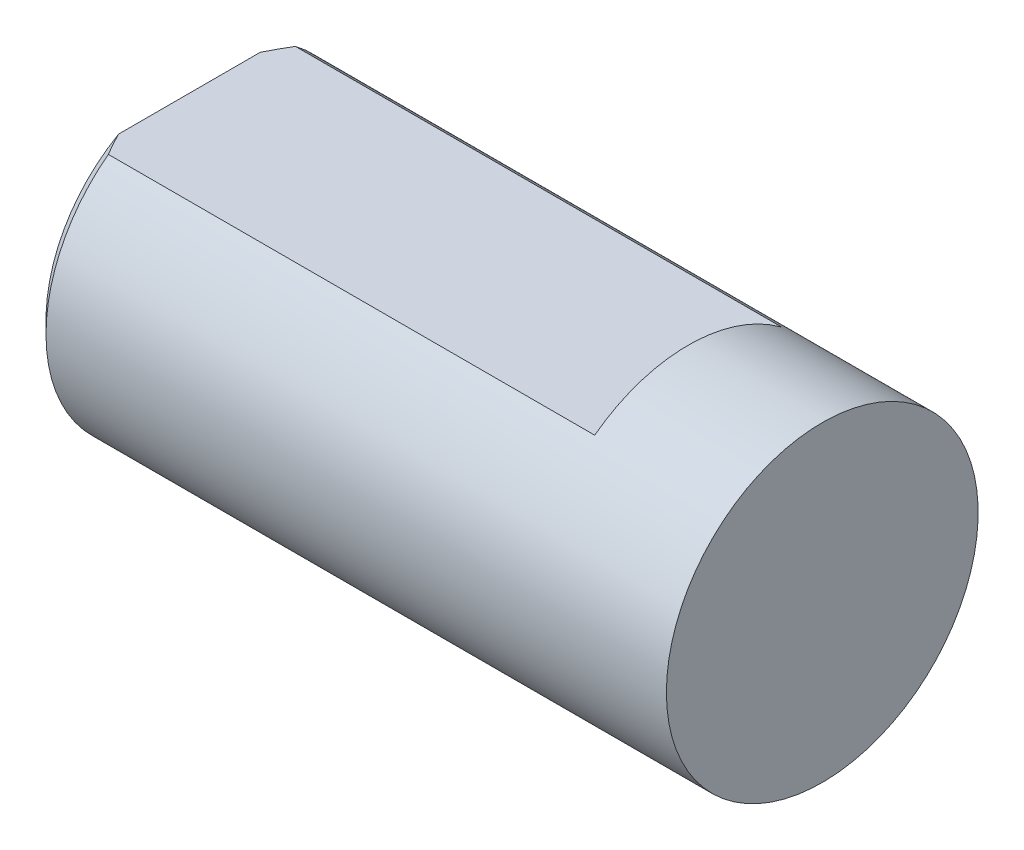
ISO-10303-21;
HEADER;
FILE_DESCRIPTION(('STEP AP214'),'2;1');
FILE_NAME('part.step','',(''),(''),'','','');
FILE_SCHEMA(('AUTOMOTIVE_DESIGN { 1 0 10303 214 1 1 1 1 }'));
ENDSEC;
DATA;
#1=APPLICATION_CONTEXT('core data for automotive mechanical design processes');
#2=APPLICATION_PROTOCOL_DEFINITION('international standard','automotive_design',2000,#1);
#3=PRODUCT_CONTEXT('',#1,'mechanical');
#4=PRODUCT('Part','Part','',(#3));
#5=PRODUCT_RELATED_PRODUCT_CATEGORY('part','',(#4));
#6=PRODUCT_DEFINITION_FORMATION('','',#4);
#7=PRODUCT_DEFINITION_CONTEXT('part definition',#1,'design');
#8=PRODUCT_DEFINITION('design','',#6,#7);
#9=PRODUCT_DEFINITION_SHAPE('','',#8);
#10=(LENGTH_UNIT() NAMED_UNIT(*) SI_UNIT(.MILLI.,.METRE.));
#11=(NAMED_UNIT(*) PLANE_ANGLE_UNIT() SI_UNIT($,.RADIAN.));
#12=(NAMED_UNIT(*) SI_UNIT($,.STERADIAN.) SOLID_ANGLE_UNIT());
#13=UNCERTAINTY_MEASURE_WITH_UNIT(LENGTH_MEASURE(1.E-05),#10,'distance_accuracy_value','');
#14=(GEOMETRIC_REPRESENTATION_CONTEXT(3) GLOBAL_UNCERTAINTY_ASSIGNED_CONTEXT((#13)) GLOBAL_UNIT_ASSIGNED_CONTEXT((#10,
#11,#12)) REPRESENTATION_CONTEXT('',''));
#15=CARTESIAN_POINT('',(0.,0.,0.));
#16=DIRECTION('',(0.,0.,1.));
#17=DIRECTION('',(1.,0.,0.));
#18=AXIS2_PLACEMENT_3D('',#15,#16,#17);
#19=CARTESIAN_POINT('',(0.,0.,0.));
#20=DIRECTION('',(-1.,0.,0.));
#21=DIRECTION('',(0.,0.,1.));
#22=AXIS2_PLACEMENT_3D('',#19,#20,#21);
#23=PLANE('',#22);
#24=CARTESIAN_POINT('',(0.,0.,0.));
#25=DIRECTION('',(-1.,0.,0.));
#26=DIRECTION('',(0.,0.,1.));
#27=AXIS2_PLACEMENT_3D('',#24,#25,#26);
#28=CIRCLE('',#27,2.5);
#29=CARTESIAN_POINT('',(0.,0.,2.5));
#30=VERTEX_POINT('',#29);
#31=EDGE_CURVE('E78',#30,#30,#28,.T.);
#32=ORIENTED_EDGE('',*,*,#31,.F.);
#33=EDGE_LOOP('',(#32));
#34=FACE_BOUND('',#33,.T.);
#35=ADVANCED_FACE('F32',(#34),#23,.F.);
#36=CARTESIAN_POINT('',(0.,0.,0.));
#37=DIRECTION('',(-1.,0.,0.));
#38=DIRECTION('',(0.,0.,1.));
#39=AXIS2_PLACEMENT_3D('',#36,#37,#38);
#40=CYLINDRICAL_SURFACE('',#39,2.5);
#41=DIRECTION('',(-1.,0.,0.));
#42=VECTOR('',#41,1.);
#43=CARTESIAN_POINT('',(-2.15,2.,1.5));
#44=LINE('',#43,#42);
#45=CARTESIAN_POINT('',(-2.15,2.,1.5));
#46=VERTEX_POINT('',#45);
#47=CARTESIAN_POINT('',(-9.95,2.,1.5));
#48=VERTEX_POINT('',#47);
#49=EDGE_CURVE('E67',#46,#48,#44,.T.);
#50=ORIENTED_EDGE('',*,*,#49,.T.);
#51=CARTESIAN_POINT('',(-9.95,0.,0.));
#52=DIRECTION('',(1.,0.,0.));
#53=DIRECTION('',(0.,0.,-1.));
#54=AXIS2_PLACEMENT_3D('',#51,#52,#53);
#55=CIRCLE('',#54,2.5);
#56=CARTESIAN_POINT('',(-9.95,2.,-1.5));
#57=VERTEX_POINT('',#56);
#58=EDGE_CURVE('E11',#48,#57,#55,.T.);
#59=ORIENTED_EDGE('',*,*,#58,.T.);
#60=DIRECTION('',(-1.,0.,0.));
#61=VECTOR('',#60,1.);
#62=CARTESIAN_POINT('',(-2.15,2.,-1.5));
#63=LINE('',#62,#61);
#64=CARTESIAN_POINT('',(-2.15,2.,-1.5));
#65=VERTEX_POINT('',#64);
#66=EDGE_CURVE('E65',#65,#57,#63,.T.);
#67=ORIENTED_EDGE('',*,*,#66,.F.);
#68=CARTESIAN_POINT('',(-2.15,0.,0.));
#69=DIRECTION('',(-1.,0.,0.));
#70=DIRECTION('',(0.,0.,1.));
#71=AXIS2_PLACEMENT_3D('',#68,#69,#70);
#72=CIRCLE('',#71,2.5);
#73=EDGE_CURVE('E70',#46,#65,#72,.T.);
#74=ORIENTED_EDGE('',*,*,#73,.F.);
#75=EDGE_LOOP('',(#50,#59,#67,#74));
#76=FACE_BOUND('',#75,.T.);
#77=ORIENTED_EDGE('',*,*,#31,.T.);
#78=EDGE_LOOP('',(#77));
#79=FACE_BOUND('',#78,.T.);
#80=ADVANCED_FACE('F75',(#76,#79),#40,.T.);
#81=CARTESIAN_POINT('',(-10.15,2.5,0.));
#82=DIRECTION('',(1.,0.,0.));
#83=DIRECTION('',(0.,0.,-1.));
#84=AXIS2_PLACEMENT_3D('',#81,#82,#83);
#85=PLANE('',#84);
#86=DIRECTION('',(0.,0.,1.));
#87=VECTOR('',#86,1.);
#88=CARTESIAN_POINT('',(-10.15,2.,0.));
#89=LINE('',#88,#87);
#90=CARTESIAN_POINT('',(-10.15,2.,-1.13578166916006));
#91=VERTEX_POINT('',#90);
#92=CARTESIAN_POINT('',(-10.15,2.,1.13578166916006));
#93=VERTEX_POINT('',#92);
#94=EDGE_CURVE('E73',#91,#93,#89,.T.);
#95=ORIENTED_EDGE('',*,*,#94,.F.);
#96=CARTESIAN_POINT('',(-10.15,0.,0.));
#97=DIRECTION('',(1.,0.,0.));
#98=DIRECTION('',(0.,0.,-1.));
#99=AXIS2_PLACEMENT_3D('',#96,#97,#98);
#100=CIRCLE('',#99,2.3);
#101=EDGE_CURVE('E83',#91,#93,#100,.F.);
#102=ORIENTED_EDGE('',*,*,#101,.T.);
#103=EDGE_LOOP('',(#95,#102));
#104=FACE_BOUND('',#103,.T.);
#105=ADVANCED_FACE('F101',(#104),#85,.F.);
#106=CARTESIAN_POINT('',(-2.15,2.,0.));
#107=DIRECTION('',(0.,-1.,0.));
#108=DIRECTION('',(0.,0.,-1.));
#109=AXIS2_PLACEMENT_3D('',#106,#107,#108);
#110=PLANE('',#109);
#111=ORIENTED_EDGE('',*,*,#94,.T.);
#112=CARTESIAN_POINT('',(-10.15,2.,1.13578166916006));
#113=CARTESIAN_POINT('',(-10.1346588897814,2.,1.16684531148886));
#114=CARTESIAN_POINT('',(-10.1189381376528,2.,1.19771947914308));
#115=CARTESIAN_POINT('',(-10.0868162971825,2.,1.25909582358931));
#116=CARTESIAN_POINT('',(-10.070415494086,2.,1.28959814953928));
#117=CARTESIAN_POINT('',(-10.0370005487157,2.,1.35026188212942));
#118=CARTESIAN_POINT('',(-10.0199864399502,2.,1.380423307277));
#119=CARTESIAN_POINT('',(-9.98539731601963,2.,1.44043971345171));
#120=CARTESIAN_POINT('',(-9.96782207083391,2.,1.47029456200406));
#121=CARTESIAN_POINT('',(-9.95,2.,1.5));
#122=B_SPLINE_CURVE_WITH_KNOTS('',3,(#112,#113,#114,#115,#116,#117,#118,#119,#120,#121),
.UNSPECIFIED.,.F.,.F.,(4,2,2,2,4),(0.,0.103930863284102,0.207818565532301,0.311700600383635,
0.415625779466399),.UNSPECIFIED.);
#123=EDGE_CURVE('E39',#93,#48,#122,.T.);
#124=ORIENTED_EDGE('',*,*,#123,.T.);
#125=ORIENTED_EDGE('',*,*,#49,.F.);
#126=DIRECTION('',(0.,0.,1.));
#127=VECTOR('',#126,1.);
#128=CARTESIAN_POINT('',(-2.15,2.,-1.5));
#129=LINE('',#128,#127);
#130=EDGE_CURVE('E62',#65,#46,#129,.T.);
#131=ORIENTED_EDGE('',*,*,#130,.F.);
#132=ORIENTED_EDGE('',*,*,#66,.T.);
#133=CARTESIAN_POINT('',(-9.95,2.,-1.5));
#134=CARTESIAN_POINT('',(-9.96782207083391,2.,-1.47029456200406));
#135=CARTESIAN_POINT('',(-9.98539731601963,2.,-1.44043971345171));
#136=CARTESIAN_POINT('',(-10.0199864399502,2.,-1.380423307277));
#137=CARTESIAN_POINT('',(-10.0370005487157,2.,-1.35026188212942));
#138=CARTESIAN_POINT('',(-10.070415494086,2.,-1.28959814953928));
#139=CARTESIAN_POINT('',(-10.0868162971825,2.,-1.25909582358931));
#140=CARTESIAN_POINT('',(-10.1189381376528,2.,-1.19771947914308));
#141=CARTESIAN_POINT('',(-10.1346588897814,2.,-1.16684531148886));
#142=CARTESIAN_POINT('',(-10.15,2.,-1.13578166916006));
#143=B_SPLINE_CURVE_WITH_KNOTS('',3,(#133,#134,#135,#136,#137,#138,#139,#140,#141,#142),
.UNSPECIFIED.,.F.,.F.,(4,2,2,2,4),(0.,0.103925179082765,0.207807213934099,0.311694916182298,
0.4156257794664),.UNSPECIFIED.);
#144=EDGE_CURVE('E86',#57,#91,#143,.T.);
#145=ORIENTED_EDGE('',*,*,#144,.T.);
#146=EDGE_LOOP('',(#111,#124,#125,#131,#132,#145));
#147=FACE_BOUND('',#146,.T.);
#148=ADVANCED_FACE('F64',(#147),#110,.F.);
#149=CARTESIAN_POINT('',(-2.15,0.,0.));
#150=DIRECTION('',(-1.,0.,0.));
#151=DIRECTION('',(0.,0.,1.));
#152=AXIS2_PLACEMENT_3D('',#149,#150,#151);
#153=PLANE('',#152);
#154=ORIENTED_EDGE('',*,*,#73,.T.);
#155=ORIENTED_EDGE('',*,*,#130,.T.);
#156=EDGE_LOOP('',(#154,#155));
#157=FACE_BOUND('',#156,.T.);
#158=ADVANCED_FACE('F72',(#157),#153,.T.);
#159=CARTESIAN_POINT('',(-10.15,0.,0.));
#160=DIRECTION('',(1.,0.,0.));
#161=DIRECTION('',(0.,0.,-1.));
#162=AXIS2_PLACEMENT_3D('',#159,#160,#161);
#163=CONICAL_SURFACE('',#162,2.3,0.785398163397442);
#164=ORIENTED_EDGE('',*,*,#144,.F.);
#165=ORIENTED_EDGE('',*,*,#58,.F.);
#166=ORIENTED_EDGE('',*,*,#123,.F.);
#167=ORIENTED_EDGE('',*,*,#101,.F.);
#168=EDGE_LOOP('',(#164,#165,#166,#167));
#169=FACE_BOUND('',#168,.T.);
#170=ADVANCED_FACE('F95',(#169),#163,.T.);
#171=CLOSED_SHELL('',(#35,#80,#105,#148,#158,#170));
#172=MANIFOLD_SOLID_BREP('B2',#171);
#173=ADVANCED_BREP_SHAPE_REPRESENTATION('',(#18,#172),#14);
#174=SHAPE_DEFINITION_REPRESENTATION(#9,#173);
ENDSEC;
END-ISO-10303-21;
